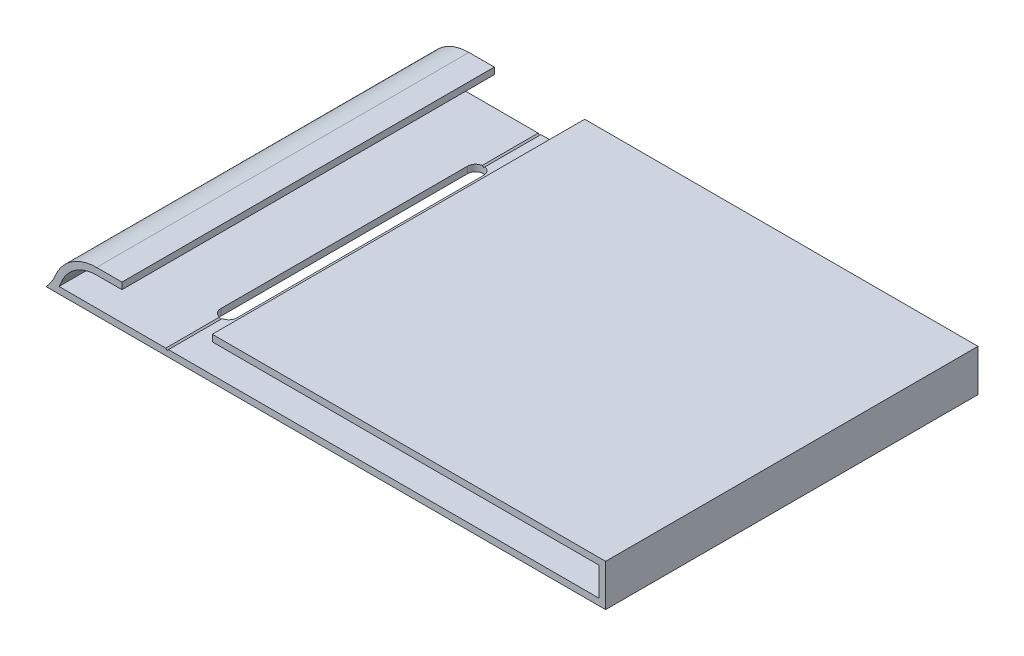
ISO-10303-21;
HEADER;
FILE_DESCRIPTION(('STEP AP214'),'2;1');
FILE_NAME('part.step','',(''),(''),'','','');
FILE_SCHEMA(('AUTOMOTIVE_DESIGN { 1 0 10303 214 1 1 1 1 }'));
ENDSEC;
DATA;
#1=APPLICATION_CONTEXT('core data for automotive mechanical design processes');
#2=APPLICATION_PROTOCOL_DEFINITION('international standard','automotive_design',2000,#1);
#3=PRODUCT_CONTEXT('',#1,'mechanical');
#4=PRODUCT('Part','Part','',(#3));
#5=PRODUCT_RELATED_PRODUCT_CATEGORY('part','',(#4));
#6=PRODUCT_DEFINITION_FORMATION('','',#4);
#7=PRODUCT_DEFINITION_CONTEXT('part definition',#1,'design');
#8=PRODUCT_DEFINITION('design','',#6,#7);
#9=PRODUCT_DEFINITION_SHAPE('','',#8);
#10=(LENGTH_UNIT() NAMED_UNIT(*) SI_UNIT(.MILLI.,.METRE.));
#11=(NAMED_UNIT(*) PLANE_ANGLE_UNIT() SI_UNIT($,.RADIAN.));
#12=(NAMED_UNIT(*) SI_UNIT($,.STERADIAN.) SOLID_ANGLE_UNIT());
#13=UNCERTAINTY_MEASURE_WITH_UNIT(LENGTH_MEASURE(1.E-05),#10,'distance_accuracy_value','');
#14=(GEOMETRIC_REPRESENTATION_CONTEXT(3) GLOBAL_UNCERTAINTY_ASSIGNED_CONTEXT((#13)) GLOBAL_UNIT_ASSIGNED_CONTEXT((#10,
#11,#12)) REPRESENTATION_CONTEXT('',''));
#15=CARTESIAN_POINT('',(0.,0.,0.));
#16=DIRECTION('',(0.,0.,1.));
#17=DIRECTION('',(1.,0.,0.));
#18=AXIS2_PLACEMENT_3D('',#15,#16,#17);
#19=CARTESIAN_POINT('',(-66.6999999999992,102.,100.67082039325));
#20=DIRECTION('',(0.707106781186531,-0.707106781186564,0.));
#21=DIRECTION('',(0.707106781186564,0.707106781186531,0.));
#22=AXIS2_PLACEMENT_3D('',#19,#20,#21);
#23=PLANE('',#22);
#24=DIRECTION('',(0.,0.,-1.));
#25=VECTOR('',#24,1.);
#26=CARTESIAN_POINT('',(-66.6999999999992,102.,100.67082039325));
#27=LINE('',#26,#25);
#28=CARTESIAN_POINT('',(-66.6999999999992,102.,-241.5));
#29=VERTEX_POINT('',#28);
#30=CARTESIAN_POINT('',(-66.6999999999992,102.,-253.699826397253));
#31=VERTEX_POINT('',#30);
#32=EDGE_CURVE('E256',#29,#31,#27,.T.);
#33=ORIENTED_EDGE('',*,*,#32,.T.);
#34=CARTESIAN_POINT('',(-67.0000000000007,101.699999999998,-255.5));
#35=DIRECTION('',(0.707106781186531,-0.707106781186564,0.));
#36=DIRECTION('',(0.707106781186564,0.707106781186531,0.));
#37=AXIS2_PLACEMENT_3D('',#34,#35,#36);
#38=ELLIPSE('',#37,2.58093975134183,1.82500000000778);
#39=CARTESIAN_POINT('',(-66.9999999999992,101.7,-253.674999999992));
#40=VERTEX_POINT('',#39);
#41=EDGE_CURVE('E219',#31,#40,#38,.T.);
#42=ORIENTED_EDGE('',*,*,#41,.T.);
#43=DIRECTION('',(0.,0.,-1.));
#44=VECTOR('',#43,1.);
#45=CARTESIAN_POINT('',(-66.9999999999992,101.7,100.67082039325));
#46=LINE('',#45,#44);
#47=CARTESIAN_POINT('',(-66.9999999999992,101.7,-241.5));
#48=VERTEX_POINT('',#47);
#49=EDGE_CURVE('E253',#48,#40,#46,.T.);
#50=ORIENTED_EDGE('',*,*,#49,.F.);
#51=DIRECTION('',(-0.707106781186564,-0.707106781186531,0.));
#52=VECTOR('',#51,1.);
#53=CARTESIAN_POINT('',(-84.3499999999979,84.3500000000017,-241.5));
#54=LINE('',#53,#52);
#55=EDGE_CURVE('E262',#29,#48,#54,.T.);
#56=ORIENTED_EDGE('',*,*,#55,.F.);
#57=EDGE_LOOP('',(#33,#42,#50,#56));
#58=FACE_BOUND('',#57,.T.);
#59=ADVANCED_FACE('F35',(#58),#23,.F.);
#60=CARTESIAN_POINT('',(-66.9999999999992,101.7,100.67082039325));
#61=DIRECTION('',(-0.707106781186531,-0.707106781186564,0.));
#62=DIRECTION('',(0.707106781186564,-0.707106781186531,0.));
#63=AXIS2_PLACEMENT_3D('',#60,#61,#62);
#64=PLANE('',#63);
#65=ORIENTED_EDGE('',*,*,#49,.T.);
#66=CARTESIAN_POINT('',(-67.0000000000007,101.700000000001,-255.5));
#67=DIRECTION('',(-0.707106781186531,-0.707106781186564,0.));
#68=DIRECTION('',(-0.707106781186564,0.707106781186531,0.));
#69=AXIS2_PLACEMENT_3D('',#66,#67,#68);
#70=ELLIPSE('',#69,2.58093975134185,1.82500000000778);
#71=CARTESIAN_POINT('',(-67.2999999999992,102.,-253.699826397252));
#72=VERTEX_POINT('',#71);
#73=EDGE_CURVE('E365',#40,#72,#70,.T.);
#74=ORIENTED_EDGE('',*,*,#73,.T.);
#75=DIRECTION('',(0.,0.,-1.));
#76=VECTOR('',#75,1.);
#77=CARTESIAN_POINT('',(-67.2999999999992,102.,100.67082039325));
#78=LINE('',#77,#76);
#79=CARTESIAN_POINT('',(-67.2999999999992,102.,-241.5));
#80=VERTEX_POINT('',#79);
#81=EDGE_CURVE('E249',#80,#72,#78,.T.);
#82=ORIENTED_EDGE('',*,*,#81,.F.);
#83=DIRECTION('',(-0.707106781186564,0.707106781186531,0.));
#84=VECTOR('',#83,1.);
#85=CARTESIAN_POINT('',(17.3500000000018,17.3500000000026,-241.5));
#86=LINE('',#85,#84);
#87=EDGE_CURVE('E259',#48,#80,#86,.T.);
#88=ORIENTED_EDGE('',*,*,#87,.F.);
#89=EDGE_LOOP('',(#65,#74,#82,#88));
#90=FACE_BOUND('',#89,.T.);
#91=ADVANCED_FACE('F391',(#90),#64,.F.);
#92=CARTESIAN_POINT('',(0.,110.,-421.5));
#93=DIRECTION('',(0.,-1.,0.));
#94=DIRECTION('',(0.,0.,-1.));
#95=AXIS2_PLACEMENT_3D('',#92,#93,#94);
#96=PLANE('',#95);
#97=DIRECTION('',(1.,0.,0.));
#98=VECTOR('',#97,1.);
#99=CARTESIAN_POINT('',(0.,110.,-241.5));
#100=LINE('',#99,#98);
#101=CARTESIAN_POINT('',(-83.,110.,-241.5));
#102=VERTEX_POINT('',#101);
#103=CARTESIAN_POINT('',(-77.25,110.,-241.5));
#104=VERTEX_POINT('',#103);
#105=EDGE_CURVE('E316',#102,#104,#100,.T.);
#106=ORIENTED_EDGE('',*,*,#105,.T.);
#107=DIRECTION('',(0.,0.,-1.));
#108=VECTOR('',#107,1.);
#109=CARTESIAN_POINT('',(-77.25,110.,-169.5));
#110=LINE('',#109,#108);
#111=CARTESIAN_POINT('',(-77.25,110.,-326.));
#112=VERTEX_POINT('',#111);
#113=EDGE_CURVE('E233',#104,#112,#110,.T.);
#114=ORIENTED_EDGE('',*,*,#113,.T.);
#115=DIRECTION('',(1.,0.,0.));
#116=VECTOR('',#115,1.);
#117=CARTESIAN_POINT('',(-120.,110.,-326.));
#118=LINE('',#117,#116);
#119=CARTESIAN_POINT('',(-83.,110.,-326.));
#120=VERTEX_POINT('',#119);
#121=EDGE_CURVE('E266',#120,#112,#118,.T.);
#122=ORIENTED_EDGE('',*,*,#121,.F.);
#123=DIRECTION('',(0.,0.,1.));
#124=VECTOR('',#123,1.);
#125=CARTESIAN_POINT('',(-83.,110.,-421.5));
#126=LINE('',#125,#124);
#127=EDGE_CURVE('E334',#120,#102,#126,.T.);
#128=ORIENTED_EDGE('',*,*,#127,.T.);
#129=EDGE_LOOP('',(#106,#114,#122,#128));
#130=FACE_BOUND('',#129,.T.);
#131=ADVANCED_FACE('F437',(#130),#96,.F.);
#132=CARTESIAN_POINT('',(0.,108.5,-421.5));
#133=DIRECTION('',(0.,-1.,0.));
#134=DIRECTION('',(0.,0.,-1.));
#135=AXIS2_PLACEMENT_3D('',#132,#133,#134);
#136=PLANE('',#135);
#137=DIRECTION('',(0.,0.,1.));
#138=VECTOR('',#137,1.);
#139=CARTESIAN_POINT('',(-56.75,108.5,-421.5));
#140=LINE('',#139,#138);
#141=CARTESIAN_POINT('',(-56.75,108.5,-326.));
#142=VERTEX_POINT('',#141);
#143=CARTESIAN_POINT('',(-56.75,108.5,-241.5));
#144=VERTEX_POINT('',#143);
#145=EDGE_CURVE('E236',#142,#144,#140,.T.);
#146=ORIENTED_EDGE('',*,*,#145,.F.);
#147=DIRECTION('',(-1.,0.,0.));
#148=VECTOR('',#147,1.);
#149=CARTESIAN_POINT('',(0.,108.5,-326.));
#150=LINE('',#149,#148);
#151=CARTESIAN_POINT('',(31.,108.5,-326.));
#152=VERTEX_POINT('',#151);
#153=EDGE_CURVE('E278',#152,#142,#150,.T.);
#154=ORIENTED_EDGE('',*,*,#153,.F.);
#155=DIRECTION('',(0.,0.,1.));
#156=VECTOR('',#155,1.);
#157=CARTESIAN_POINT('',(31.,108.5,-421.5));
#158=LINE('',#157,#156);
#159=CARTESIAN_POINT('',(31.,108.5,-241.5));
#160=VERTEX_POINT('',#159);
#161=EDGE_CURVE('E340',#152,#160,#158,.T.);
#162=ORIENTED_EDGE('',*,*,#161,.T.);
#163=DIRECTION('',(1.,0.,0.));
#164=VECTOR('',#163,1.);
#165=CARTESIAN_POINT('',(0.,108.5,-241.5));
#166=LINE('',#165,#164);
#167=EDGE_CURVE('E305',#144,#160,#166,.T.);
#168=ORIENTED_EDGE('',*,*,#167,.F.);
#169=EDGE_LOOP('',(#146,#154,#162,#168));
#170=FACE_BOUND('',#169,.T.);
#171=ADVANCED_FACE('F409',(#170),#136,.T.);
#172=CARTESIAN_POINT('',(0.,102.,-421.5));
#173=DIRECTION('',(0.,1.,0.));
#174=DIRECTION('',(0.,0.,1.));
#175=AXIS2_PLACEMENT_3D('',#172,#173,#174);
#176=PLANE('',#175);
#177=CARTESIAN_POINT('',(-67.0000000000007,102.,-255.5));
#178=DIRECTION('',(0.,1.,0.));
#179=DIRECTION('',(0.,0.,1.));
#180=AXIS2_PLACEMENT_3D('',#177,#178,#179);
#181=CIRCLE('',#180,1.82500000000778);
#182=CARTESIAN_POINT('',(-65.1749999999922,102.,-255.5));
#183=VERTEX_POINT('',#182);
#184=EDGE_CURVE('E228',#31,#183,#181,.T.);
#185=ORIENTED_EDGE('',*,*,#184,.F.);
#186=ORIENTED_EDGE('',*,*,#32,.F.);
#187=DIRECTION('',(-1.,0.,0.));
#188=VECTOR('',#187,1.);
#189=CARTESIAN_POINT('',(0.,102.,-241.5));
#190=LINE('',#189,#188);
#191=CARTESIAN_POINT('',(31.,102.,-241.5));
#192=VERTEX_POINT('',#191);
#193=EDGE_CURVE('E299',#192,#29,#190,.T.);
#194=ORIENTED_EDGE('',*,*,#193,.F.);
#195=DIRECTION('',(0.,0.,1.));
#196=VECTOR('',#195,1.);
#197=CARTESIAN_POINT('',(31.,102.,-421.5));
#198=LINE('',#197,#196);
#199=CARTESIAN_POINT('',(31.,102.,-326.));
#200=VERTEX_POINT('',#199);
#201=EDGE_CURVE('E343',#200,#192,#198,.T.);
#202=ORIENTED_EDGE('',*,*,#201,.F.);
#203=DIRECTION('',(1.,0.,0.));
#204=VECTOR('',#203,1.);
#205=CARTESIAN_POINT('',(0.,102.,-326.));
#206=LINE('',#205,#204);
#207=CARTESIAN_POINT('',(-66.6999999999992,102.,-326.));
#208=VERTEX_POINT('',#207);
#209=EDGE_CURVE('E283',#208,#200,#206,.T.);
#210=ORIENTED_EDGE('',*,*,#209,.F.);
#211=CARTESIAN_POINT('',(-66.6999999999992,102.,-313.300173602747));
#212=VERTEX_POINT('',#211);
#213=EDGE_CURVE('E216',#212,#208,#27,.T.);
#214=ORIENTED_EDGE('',*,*,#213,.F.);
#215=CARTESIAN_POINT('',(-67.0000000000007,102.,-311.5));
#216=DIRECTION('',(0.,1.,0.));
#217=DIRECTION('',(0.,0.,1.));
#218=AXIS2_PLACEMENT_3D('',#215,#216,#217);
#219=CIRCLE('',#218,1.82500000000778);
#220=CARTESIAN_POINT('',(-65.1749999999922,102.,-311.5));
#221=VERTEX_POINT('',#220);
#222=EDGE_CURVE('E206',#221,#212,#219,.T.);
#223=ORIENTED_EDGE('',*,*,#222,.F.);
#224=DIRECTION('',(0.,0.,-1.));
#225=VECTOR('',#224,1.);
#226=CARTESIAN_POINT('',(-65.1749999999922,102.,-421.5));
#227=LINE('',#226,#225);
#228=EDGE_CURVE('E195',#183,#221,#227,.T.);
#229=ORIENTED_EDGE('',*,*,#228,.F.);
#230=EDGE_LOOP('',(#185,#186,#194,#202,#210,#214,#223,#229));
#231=FACE_BOUND('',#230,.T.);
#232=ADVANCED_FACE('F214',(#231),#176,.T.);
#233=CARTESIAN_POINT('',(-101.758107565017,107.555793957317,-421.5));
#234=DIRECTION('',(0.,0.,1.));
#235=DIRECTION('',(1.,0.,0.));
#236=AXIS2_PLACEMENT_3D('',#233,#234,#235);
#237=CYLINDRICAL_SURFACE('',#236,10.1371613475259);
#238=CARTESIAN_POINT('',(-101.758107565017,107.555793957317,-326.));
#239=DIRECTION('',(0.,0.,1.));
#240=DIRECTION('',(1.,0.,0.));
#241=AXIS2_PLACEMENT_3D('',#238,#239,#240);
#242=CIRCLE('',#241,10.1371613475259);
#243=CARTESIAN_POINT('',(-94.4795217258819,100.5,-326.));
#244=VERTEX_POINT('',#243);
#245=CARTESIAN_POINT('',(-92.3790537825084,103.709316304896,-326.));
#246=VERTEX_POINT('',#245);
#247=EDGE_CURVE('E272',#244,#246,#242,.T.);
#248=ORIENTED_EDGE('',*,*,#247,.F.);
#249=DIRECTION('',(0.,0.,1.));
#250=VECTOR('',#249,1.);
#251=CARTESIAN_POINT('',(-94.4795217258819,100.5,-421.5));
#252=LINE('',#251,#250);
#253=CARTESIAN_POINT('',(-94.4795217258819,100.5,-241.5));
#254=VERTEX_POINT('',#253);
#255=EDGE_CURVE('E326',#244,#254,#252,.T.);
#256=ORIENTED_EDGE('',*,*,#255,.T.);
#257=CARTESIAN_POINT('',(-101.758107565017,107.555793957317,-241.5));
#258=DIRECTION('',(0.,0.,-1.));
#259=DIRECTION('',(-1.,0.,0.));
#260=AXIS2_PLACEMENT_3D('',#257,#258,#259);
#261=CIRCLE('',#260,10.1371613475259);
#262=CARTESIAN_POINT('',(-92.3790537825084,103.709316304896,-241.5));
#263=VERTEX_POINT('',#262);
#264=EDGE_CURVE('E309',#263,#254,#261,.T.);
#265=ORIENTED_EDGE('',*,*,#264,.F.);
#266=DIRECTION('',(0.,0.,1.));
#267=VECTOR('',#266,1.);
#268=CARTESIAN_POINT('',(-92.3790537825084,103.709316304896,-421.5));
#269=LINE('',#268,#267);
#270=EDGE_CURVE('E336',#246,#263,#269,.T.);
#271=ORIENTED_EDGE('',*,*,#270,.F.);
#272=EDGE_LOOP('',(#248,#256,#265,#271));
#273=FACE_BOUND('',#272,.T.);
#274=ADVANCED_FACE('F428',(#273),#237,.F.);
#275=CARTESIAN_POINT('',(-83.,99.8628386524749,-421.5));
#276=DIRECTION('',(0.,0.,1.));
#277=DIRECTION('',(1.,0.,0.));
#278=AXIS2_PLACEMENT_3D('',#275,#276,#277);
#279=CYLINDRICAL_SURFACE('',#278,10.1371613475251);
#280=ORIENTED_EDGE('',*,*,#127,.F.);
#281=CARTESIAN_POINT('',(-83.,99.8628386524749,-326.));
#282=DIRECTION('',(0.,0.,1.));
#283=DIRECTION('',(1.,0.,0.));
#284=AXIS2_PLACEMENT_3D('',#281,#282,#283);
#285=CIRCLE('',#284,10.1371613475251);
#286=EDGE_CURVE('E274',#120,#246,#285,.T.);
#287=ORIENTED_EDGE('',*,*,#286,.T.);
#288=ORIENTED_EDGE('',*,*,#270,.T.);
#289=CARTESIAN_POINT('',(-83.,99.8628386524749,-241.5));
#290=DIRECTION('',(0.,0.,-1.));
#291=DIRECTION('',(-1.,0.,0.));
#292=AXIS2_PLACEMENT_3D('',#289,#290,#291);
#293=CIRCLE('',#292,10.1371613475251);
#294=EDGE_CURVE('E312',#263,#102,#293,.T.);
#295=ORIENTED_EDGE('',*,*,#294,.T.);
#296=EDGE_LOOP('',(#280,#287,#288,#295));
#297=FACE_BOUND('',#296,.T.);
#298=ADVANCED_FACE('F433',(#297),#279,.T.);
#299=CARTESIAN_POINT('',(-56.75,110.,-326.));
#300=VERTEX_POINT('',#299);
#301=CARTESIAN_POINT('',(32.5,110.,-326.));
#302=VERTEX_POINT('',#301);
#303=EDGE_CURVE('E265',#300,#302,#118,.T.);
#304=ORIENTED_EDGE('',*,*,#303,.F.);
#305=DIRECTION('',(0.,0.,-1.));
#306=VECTOR('',#305,1.);
#307=CARTESIAN_POINT('',(-56.75,110.,-169.5));
#308=LINE('',#307,#306);
#309=CARTESIAN_POINT('',(-56.75,110.,-241.5));
#310=VERTEX_POINT('',#309);
#311=EDGE_CURVE('E234',#310,#300,#308,.T.);
#312=ORIENTED_EDGE('',*,*,#311,.F.);
#313=CARTESIAN_POINT('',(32.5,110.,-241.5));
#314=VERTEX_POINT('',#313);
#315=EDGE_CURVE('E315',#310,#314,#100,.T.);
#316=ORIENTED_EDGE('',*,*,#315,.T.);
#317=DIRECTION('',(0.,0.,1.));
#318=VECTOR('',#317,1.);
#319=CARTESIAN_POINT('',(32.5,110.,-421.5));
#320=LINE('',#319,#318);
#321=EDGE_CURVE('E331',#302,#314,#320,.T.);
#322=ORIENTED_EDGE('',*,*,#321,.F.);
#323=EDGE_LOOP('',(#304,#312,#316,#322));
#324=FACE_BOUND('',#323,.T.);
#325=ADVANCED_FACE('F420',(#324),#96,.F.);
#326=CARTESIAN_POINT('',(32.5,0.,-421.5));
#327=DIRECTION('',(-1.,0.,0.));
#328=DIRECTION('',(0.,0.,1.));
#329=AXIS2_PLACEMENT_3D('',#326,#327,#328);
#330=PLANE('',#329);
#331=DIRECTION('',(0.,0.,1.));
#332=VECTOR('',#331,1.);
#333=CARTESIAN_POINT('',(32.5,100.5,-421.5));
#334=LINE('',#333,#332);
#335=CARTESIAN_POINT('',(32.5,100.5,-326.));
#336=VERTEX_POINT('',#335);
#337=CARTESIAN_POINT('',(32.5,100.5,-241.5));
#338=VERTEX_POINT('',#337);
#339=EDGE_CURVE('E328',#336,#338,#334,.T.);
#340=ORIENTED_EDGE('',*,*,#339,.F.);
#341=DIRECTION('',(0.,1.,0.));
#342=VECTOR('',#341,1.);
#343=CARTESIAN_POINT('',(32.5,0.,-326.));
#344=LINE('',#343,#342);
#345=EDGE_CURVE('E269',#336,#302,#344,.T.);
#346=ORIENTED_EDGE('',*,*,#345,.T.);
#347=ORIENTED_EDGE('',*,*,#321,.T.);
#348=DIRECTION('',(0.,-1.,0.));
#349=VECTOR('',#348,1.);
#350=CARTESIAN_POINT('',(32.5,0.,-241.5));
#351=LINE('',#350,#349);
#352=EDGE_CURVE('E319',#314,#338,#351,.T.);
#353=ORIENTED_EDGE('',*,*,#352,.T.);
#354=EDGE_LOOP('',(#340,#346,#347,#353));
#355=FACE_BOUND('',#354,.T.);
#356=ADVANCED_FACE('F423',(#355),#330,.F.);
#357=CARTESIAN_POINT('',(-83.,99.8628386524749,-421.5));
#358=DIRECTION('',(0.,0.,1.));
#359=DIRECTION('',(1.,0.,0.));
#360=AXIS2_PLACEMENT_3D('',#357,#358,#359);
#361=CYLINDRICAL_SURFACE('',#360,8.63716134752511);
#362=CARTESIAN_POINT('',(-83.,99.8628386524749,-326.));
#363=DIRECTION('',(0.,0.,1.));
#364=DIRECTION('',(1.,0.,0.));
#365=AXIS2_PLACEMENT_3D('',#362,#363,#364);
#366=CIRCLE('',#365,8.63716134752511);
#367=CARTESIAN_POINT('',(-83.,108.5,-326.));
#368=VERTEX_POINT('',#367);
#369=CARTESIAN_POINT('',(-90.9912312756488,103.14015139957,-326.));
#370=VERTEX_POINT('',#369);
#371=EDGE_CURVE('E290',#368,#370,#366,.T.);
#372=ORIENTED_EDGE('',*,*,#371,.F.);
#373=DIRECTION('',(0.,0.,1.));
#374=VECTOR('',#373,1.);
#375=CARTESIAN_POINT('',(-83.,108.5,-421.5));
#376=LINE('',#375,#374);
#377=CARTESIAN_POINT('',(-83.,108.5,-241.5));
#378=VERTEX_POINT('',#377);
#379=EDGE_CURVE('E325',#368,#378,#376,.T.);
#380=ORIENTED_EDGE('',*,*,#379,.T.);
#381=CARTESIAN_POINT('',(-83.,99.8628386524749,-241.5));
#382=DIRECTION('',(0.,0.,-1.));
#383=DIRECTION('',(-1.,0.,0.));
#384=AXIS2_PLACEMENT_3D('',#381,#382,#383);
#385=CIRCLE('',#384,8.63716134752511);
#386=CARTESIAN_POINT('',(-90.9912312756488,103.14015139957,-241.5));
#387=VERTEX_POINT('',#386);
#388=EDGE_CURVE('E292',#387,#378,#385,.T.);
#389=ORIENTED_EDGE('',*,*,#388,.F.);
#390=DIRECTION('',(0.,0.,1.));
#391=VECTOR('',#390,1.);
#392=CARTESIAN_POINT('',(-90.9912312756488,103.14015139957,-421.5));
#393=LINE('',#392,#391);
#394=EDGE_CURVE('E329',#370,#387,#393,.T.);
#395=ORIENTED_EDGE('',*,*,#394,.F.);
#396=EDGE_LOOP('',(#372,#380,#389,#395));
#397=FACE_BOUND('',#396,.T.);
#398=ADVANCED_FACE('F37',(#397),#361,.F.);
#399=CARTESIAN_POINT('',(-101.758107565017,107.555793957317,-421.5));
#400=DIRECTION('',(0.,0.,1.));
#401=DIRECTION('',(1.,0.,0.));
#402=AXIS2_PLACEMENT_3D('',#399,#400,#401);
#403=CYLINDRICAL_SURFACE('',#402,11.6371613475259);
#404=DIRECTION('',(0.,0.,1.));
#405=VECTOR('',#404,1.);
#406=CARTESIAN_POINT('',(-91.5328115921767,102.,-421.5));
#407=LINE('',#406,#405);
#408=CARTESIAN_POINT('',(-91.5328115921767,102.,-326.));
#409=VERTEX_POINT('',#408);
#410=CARTESIAN_POINT('',(-91.5328115921767,102.,-241.5));
#411=VERTEX_POINT('',#410);
#412=EDGE_CURVE('E345',#409,#411,#407,.T.);
#413=ORIENTED_EDGE('',*,*,#412,.F.);
#414=CARTESIAN_POINT('',(-101.758107565017,107.555793957317,-326.));
#415=DIRECTION('',(0.,0.,1.));
#416=DIRECTION('',(1.,0.,0.));
#417=AXIS2_PLACEMENT_3D('',#414,#415,#416);
#418=CIRCLE('',#417,11.6371613475259);
#419=EDGE_CURVE('E287',#409,#370,#418,.T.);
#420=ORIENTED_EDGE('',*,*,#419,.T.);
#421=ORIENTED_EDGE('',*,*,#394,.T.);
#422=CARTESIAN_POINT('',(-101.758107565017,107.555793957317,-241.5));
#423=DIRECTION('',(0.,0.,-1.));
#424=DIRECTION('',(-1.,0.,0.));
#425=AXIS2_PLACEMENT_3D('',#422,#423,#424);
#426=CIRCLE('',#425,11.6371613475259);
#427=EDGE_CURVE('E295',#387,#411,#426,.T.);
#428=ORIENTED_EDGE('',*,*,#427,.T.);
#429=EDGE_LOOP('',(#413,#420,#421,#428));
#430=FACE_BOUND('',#429,.T.);
#431=ADVANCED_FACE('F453',(#430),#403,.T.);
#432=CARTESIAN_POINT('',(-67.0000000000007,102.,-255.5));
#433=DIRECTION('',(0.,1.,0.));
#434=DIRECTION('',(0.,0.,1.));
#435=AXIS2_PLACEMENT_3D('',#432,#433,#434);
#436=CIRCLE('',#435,1.82500000000778);
#437=CARTESIAN_POINT('',(-68.8250000000078,102.,-255.5));
#438=VERTEX_POINT('',#437);
#439=EDGE_CURVE('E226',#438,#72,#436,.T.);
#440=ORIENTED_EDGE('',*,*,#439,.F.);
#441=DIRECTION('',(0.,0.,1.));
#442=VECTOR('',#441,1.);
#443=CARTESIAN_POINT('',(-68.8250000000078,102.,-421.5));
#444=LINE('',#443,#442);
#445=CARTESIAN_POINT('',(-68.8250000000084,102.,-311.5));
#446=VERTEX_POINT('',#445);
#447=EDGE_CURVE('E202',#446,#438,#444,.T.);
#448=ORIENTED_EDGE('',*,*,#447,.F.);
#449=CARTESIAN_POINT('',(-67.0000000000007,102.,-311.5));
#450=DIRECTION('',(0.,1.,0.));
#451=DIRECTION('',(0.,0.,1.));
#452=AXIS2_PLACEMENT_3D('',#449,#450,#451);
#453=CIRCLE('',#452,1.82500000000778);
#454=CARTESIAN_POINT('',(-67.2999999999992,102.,-313.300173602747));
#455=VERTEX_POINT('',#454);
#456=EDGE_CURVE('E217',#455,#446,#453,.T.);
#457=ORIENTED_EDGE('',*,*,#456,.F.);
#458=CARTESIAN_POINT('',(-67.2999999999992,102.,-326.));
#459=VERTEX_POINT('',#458);
#460=EDGE_CURVE('E252',#455,#459,#78,.T.);
#461=ORIENTED_EDGE('',*,*,#460,.T.);
#462=EDGE_CURVE('E284',#409,#459,#206,.T.);
#463=ORIENTED_EDGE('',*,*,#462,.F.);
#464=ORIENTED_EDGE('',*,*,#412,.T.);
#465=EDGE_CURVE('E298',#80,#411,#190,.T.);
#466=ORIENTED_EDGE('',*,*,#465,.F.);
#467=ORIENTED_EDGE('',*,*,#81,.T.);
#468=EDGE_LOOP('',(#440,#448,#457,#461,#463,#464,#466,#467));
#469=FACE_BOUND('',#468,.T.);
#470=ADVANCED_FACE('F387',(#469),#176,.T.);
#471=CARTESIAN_POINT('',(31.,0.,-421.5));
#472=DIRECTION('',(-1.,0.,0.));
#473=DIRECTION('',(0.,0.,1.));
#474=AXIS2_PLACEMENT_3D('',#471,#472,#473);
#475=PLANE('',#474);
#476=DIRECTION('',(0.,1.,0.));
#477=VECTOR('',#476,1.);
#478=CARTESIAN_POINT('',(31.,0.,-326.));
#479=LINE('',#478,#477);
#480=EDGE_CURVE('E281',#200,#152,#479,.T.);
#481=ORIENTED_EDGE('',*,*,#480,.F.);
#482=ORIENTED_EDGE('',*,*,#201,.T.);
#483=DIRECTION('',(0.,-1.,0.));
#484=VECTOR('',#483,1.);
#485=CARTESIAN_POINT('',(31.,0.,-241.5));
#486=LINE('',#485,#484);
#487=EDGE_CURVE('E302',#160,#192,#486,.T.);
#488=ORIENTED_EDGE('',*,*,#487,.F.);
#489=ORIENTED_EDGE('',*,*,#161,.F.);
#490=EDGE_LOOP('',(#481,#482,#488,#489));
#491=FACE_BOUND('',#490,.T.);
#492=ADVANCED_FACE('F402',(#491),#475,.T.);
#493=DIRECTION('',(0.,0.,-1.));
#494=VECTOR('',#493,1.);
#495=CARTESIAN_POINT('',(-77.25,108.5,-421.5));
#496=LINE('',#495,#494);
#497=CARTESIAN_POINT('',(-77.25,108.5,-241.5));
#498=VERTEX_POINT('',#497);
#499=CARTESIAN_POINT('',(-77.25,108.5,-326.));
#500=VERTEX_POINT('',#499);
#501=EDGE_CURVE('E243',#498,#500,#496,.T.);
#502=ORIENTED_EDGE('',*,*,#501,.F.);
#503=EDGE_CURVE('E306',#378,#498,#166,.T.);
#504=ORIENTED_EDGE('',*,*,#503,.F.);
#505=ORIENTED_EDGE('',*,*,#379,.F.);
#506=EDGE_CURVE('E277',#500,#368,#150,.T.);
#507=ORIENTED_EDGE('',*,*,#506,.F.);
#508=EDGE_LOOP('',(#502,#504,#505,#507));
#509=FACE_BOUND('',#508,.T.);
#510=ADVANCED_FACE('F444',(#509),#136,.T.);
#511=CARTESIAN_POINT('',(0.,100.5,-421.5));
#512=DIRECTION('',(0.,1.,0.));
#513=DIRECTION('',(-1.,0.,0.));
#514=AXIS2_PLACEMENT_3D('',#511,#512,#513);
#515=PLANE('',#514);
#516=DIRECTION('',(0.,0.,1.));
#517=VECTOR('',#516,1.);
#518=CARTESIAN_POINT('',(-68.8250000000078,100.5,-421.5));
#519=LINE('',#518,#517);
#520=CARTESIAN_POINT('',(-68.8250000000084,100.5,-311.5));
#521=VERTEX_POINT('',#520);
#522=CARTESIAN_POINT('',(-68.8250000000078,100.5,-255.5));
#523=VERTEX_POINT('',#522);
#524=EDGE_CURVE('E11',#521,#523,#519,.T.);
#525=ORIENTED_EDGE('',*,*,#524,.T.);
#526=CARTESIAN_POINT('',(-67.0000000000006,100.5,-255.5));
#527=DIRECTION('',(0.,1.,0.));
#528=DIRECTION('',(-1.,0.,0.));
#529=AXIS2_PLACEMENT_3D('',#526,#527,#528);
#530=CIRCLE('',#529,1.82500000000778);
#531=CARTESIAN_POINT('',(-65.1749999999922,100.5,-255.5));
#532=VERTEX_POINT('',#531);
#533=EDGE_CURVE('E203',#523,#532,#530,.T.);
#534=ORIENTED_EDGE('',*,*,#533,.T.);
#535=DIRECTION('',(0.,0.,-1.));
#536=VECTOR('',#535,1.);
#537=CARTESIAN_POINT('',(-65.1749999999922,100.5,-421.5));
#538=LINE('',#537,#536);
#539=CARTESIAN_POINT('',(-65.1749999999922,100.5,-311.5));
#540=VERTEX_POINT('',#539);
#541=EDGE_CURVE('E43',#532,#540,#538,.T.);
#542=ORIENTED_EDGE('',*,*,#541,.T.);
#543=CARTESIAN_POINT('',(-67.0000000000007,100.5,-311.5));
#544=DIRECTION('',(0.,1.,0.));
#545=DIRECTION('',(-1.,0.,0.));
#546=AXIS2_PLACEMENT_3D('',#543,#544,#545);
#547=CIRCLE('',#546,1.82500000000778);
#548=EDGE_CURVE('E209',#540,#521,#547,.T.);
#549=ORIENTED_EDGE('',*,*,#548,.T.);
#550=EDGE_LOOP('',(#525,#534,#542,#549));
#551=FACE_BOUND('',#550,.T.);
#552=ORIENTED_EDGE('',*,*,#255,.F.);
#553=DIRECTION('',(1.,0.,0.));
#554=VECTOR('',#553,1.);
#555=CARTESIAN_POINT('',(0.,100.5,-326.));
#556=LINE('',#555,#554);
#557=EDGE_CURVE('E338',#244,#336,#556,.T.);
#558=ORIENTED_EDGE('',*,*,#557,.T.);
#559=ORIENTED_EDGE('',*,*,#339,.T.);
#560=DIRECTION('',(-1.,0.,0.));
#561=VECTOR('',#560,1.);
#562=CARTESIAN_POINT('',(0.,100.5,-241.5));
#563=LINE('',#562,#561);
#564=EDGE_CURVE('E322',#338,#254,#563,.T.);
#565=ORIENTED_EDGE('',*,*,#564,.T.);
#566=EDGE_LOOP('',(#552,#558,#559,#565));
#567=FACE_BOUND('',#566,.T.);
#568=ADVANCED_FACE('F368',(#551,#567),#515,.F.);
#569=CARTESIAN_POINT('',(0.,0.,-241.5));
#570=DIRECTION('',(0.,0.,-1.));
#571=DIRECTION('',(-1.,0.,0.));
#572=AXIS2_PLACEMENT_3D('',#569,#570,#571);
#573=PLANE('',#572);
#574=ORIENTED_EDGE('',*,*,#503,.T.);
#575=DIRECTION('',(0.,1.,0.));
#576=VECTOR('',#575,1.);
#577=CARTESIAN_POINT('',(-77.25,0.,-241.5));
#578=LINE('',#577,#576);
#579=EDGE_CURVE('E245',#498,#104,#578,.T.);
#580=ORIENTED_EDGE('',*,*,#579,.T.);
#581=ORIENTED_EDGE('',*,*,#105,.F.);
#582=ORIENTED_EDGE('',*,*,#294,.F.);
#583=ORIENTED_EDGE('',*,*,#264,.T.);
#584=ORIENTED_EDGE('',*,*,#564,.F.);
#585=ORIENTED_EDGE('',*,*,#352,.F.);
#586=ORIENTED_EDGE('',*,*,#315,.F.);
#587=DIRECTION('',(0.,-1.,0.));
#588=VECTOR('',#587,1.);
#589=CARTESIAN_POINT('',(-56.75,0.,-241.5));
#590=LINE('',#589,#588);
#591=EDGE_CURVE('E240',#310,#144,#590,.T.);
#592=ORIENTED_EDGE('',*,*,#591,.T.);
#593=ORIENTED_EDGE('',*,*,#167,.T.);
#594=ORIENTED_EDGE('',*,*,#487,.T.);
#595=ORIENTED_EDGE('',*,*,#193,.T.);
#596=ORIENTED_EDGE('',*,*,#55,.T.);
#597=ORIENTED_EDGE('',*,*,#87,.T.);
#598=ORIENTED_EDGE('',*,*,#465,.T.);
#599=ORIENTED_EDGE('',*,*,#427,.F.);
#600=ORIENTED_EDGE('',*,*,#388,.T.);
#601=EDGE_LOOP('',(#574,#580,#581,#582,#583,#584,#585,#586,#592,#593,#594,#595,#596,#597,#598,
#599,#600));
#602=FACE_BOUND('',#601,.T.);
#603=ADVANCED_FACE('F396',(#602),#573,.F.);
#604=CARTESIAN_POINT('',(-120.,-110.,-326.));
#605=DIRECTION('',(0.,0.,1.));
#606=DIRECTION('',(1.,0.,0.));
#607=AXIS2_PLACEMENT_3D('',#604,#605,#606);
#608=PLANE('',#607);
#609=ORIENTED_EDGE('',*,*,#121,.T.);
#610=DIRECTION('',(0.,-1.,0.));
#611=VECTOR('',#610,1.);
#612=CARTESIAN_POINT('',(-77.25,-110.,-326.));
#613=LINE('',#612,#611);
#614=EDGE_CURVE('E360',#112,#500,#613,.T.);
#615=ORIENTED_EDGE('',*,*,#614,.T.);
#616=ORIENTED_EDGE('',*,*,#506,.T.);
#617=ORIENTED_EDGE('',*,*,#371,.T.);
#618=ORIENTED_EDGE('',*,*,#419,.F.);
#619=ORIENTED_EDGE('',*,*,#462,.T.);
#620=DIRECTION('',(0.707106781186564,-0.707106781186531,0.));
#621=VECTOR('',#620,1.);
#622=CARTESIAN_POINT('',(12.3499999999991,22.3500000000051,-326.));
#623=LINE('',#622,#621);
#624=CARTESIAN_POINT('',(-66.9999999999992,101.7,-326.));
#625=VERTEX_POINT('',#624);
#626=EDGE_CURVE('E351',#459,#625,#623,.T.);
#627=ORIENTED_EDGE('',*,*,#626,.T.);
#628=DIRECTION('',(0.707106781186564,0.707106781186531,0.));
#629=VECTOR('',#628,1.);
#630=CARTESIAN_POINT('',(-199.350000000001,-30.6499999999958,-326.));
#631=LINE('',#630,#629);
#632=EDGE_CURVE('E354',#625,#208,#631,.T.);
#633=ORIENTED_EDGE('',*,*,#632,.T.);
#634=ORIENTED_EDGE('',*,*,#209,.T.);
#635=ORIENTED_EDGE('',*,*,#480,.T.);
#636=ORIENTED_EDGE('',*,*,#153,.T.);
#637=DIRECTION('',(0.,1.,0.));
#638=VECTOR('',#637,1.);
#639=CARTESIAN_POINT('',(-56.75,-110.,-326.));
#640=LINE('',#639,#638);
#641=EDGE_CURVE('E357',#142,#300,#640,.T.);
#642=ORIENTED_EDGE('',*,*,#641,.T.);
#643=ORIENTED_EDGE('',*,*,#303,.T.);
#644=ORIENTED_EDGE('',*,*,#345,.F.);
#645=ORIENTED_EDGE('',*,*,#557,.F.);
#646=ORIENTED_EDGE('',*,*,#247,.T.);
#647=ORIENTED_EDGE('',*,*,#286,.F.);
#648=EDGE_LOOP('',(#609,#615,#616,#617,#618,#619,#627,#633,#634,#635,#636,#642,#643,#644,#645,
#646,#647));
#649=FACE_BOUND('',#648,.T.);
#650=ADVANCED_FACE('F406',(#649),#608,.F.);
#651=CARTESIAN_POINT('',(-66.9999999999992,101.7,-313.325000000008));
#652=VERTEX_POINT('',#651);
#653=EDGE_CURVE('E248',#652,#625,#46,.T.);
#654=ORIENTED_EDGE('',*,*,#653,.F.);
#655=CARTESIAN_POINT('',(-67.0000000000007,101.699999999998,-311.5));
#656=DIRECTION('',(0.707106781186531,-0.707106781186564,0.));
#657=DIRECTION('',(0.707106781186564,0.707106781186531,0.));
#658=AXIS2_PLACEMENT_3D('',#655,#656,#657);
#659=ELLIPSE('',#658,2.58093975134183,1.82500000000778);
#660=EDGE_CURVE('E58',#652,#212,#659,.T.);
#661=ORIENTED_EDGE('',*,*,#660,.T.);
#662=ORIENTED_EDGE('',*,*,#213,.T.);
#663=ORIENTED_EDGE('',*,*,#632,.F.);
#664=EDGE_LOOP('',(#654,#661,#662,#663));
#665=FACE_BOUND('',#664,.T.);
#666=ADVANCED_FACE('F459',(#665),#23,.F.);
#667=ORIENTED_EDGE('',*,*,#460,.F.);
#668=CARTESIAN_POINT('',(-67.0000000000007,101.700000000001,-311.5));
#669=DIRECTION('',(-0.707106781186531,-0.707106781186564,0.));
#670=DIRECTION('',(-0.707106781186564,0.707106781186531,0.));
#671=AXIS2_PLACEMENT_3D('',#668,#669,#670);
#672=ELLIPSE('',#671,2.58093975134185,1.82500000000778);
#673=EDGE_CURVE('E363',#455,#652,#672,.T.);
#674=ORIENTED_EDGE('',*,*,#673,.T.);
#675=ORIENTED_EDGE('',*,*,#653,.T.);
#676=ORIENTED_EDGE('',*,*,#626,.F.);
#677=EDGE_LOOP('',(#667,#674,#675,#676));
#678=FACE_BOUND('',#677,.T.);
#679=ADVANCED_FACE('F458',(#678),#64,.F.);
#680=CARTESIAN_POINT('',(-56.75,110.,-169.5));
#681=DIRECTION('',(1.,0.,0.));
#682=DIRECTION('',(0.,0.,-1.));
#683=AXIS2_PLACEMENT_3D('',#680,#681,#682);
#684=PLANE('',#683);
#685=ORIENTED_EDGE('',*,*,#311,.T.);
#686=ORIENTED_EDGE('',*,*,#641,.F.);
#687=ORIENTED_EDGE('',*,*,#145,.T.);
#688=ORIENTED_EDGE('',*,*,#591,.F.);
#689=EDGE_LOOP('',(#685,#686,#687,#688));
#690=FACE_BOUND('',#689,.T.);
#691=ADVANCED_FACE('F412',(#690),#684,.F.);
#692=CARTESIAN_POINT('',(-77.25,110.,-169.5));
#693=DIRECTION('',(-1.,0.,0.));
#694=DIRECTION('',(0.,0.,1.));
#695=AXIS2_PLACEMENT_3D('',#692,#693,#694);
#696=PLANE('',#695);
#697=ORIENTED_EDGE('',*,*,#501,.T.);
#698=ORIENTED_EDGE('',*,*,#614,.F.);
#699=ORIENTED_EDGE('',*,*,#113,.F.);
#700=ORIENTED_EDGE('',*,*,#579,.F.);
#701=EDGE_LOOP('',(#697,#698,#699,#700));
#702=FACE_BOUND('',#701,.T.);
#703=ADVANCED_FACE('F441',(#702),#696,.F.);
#704=CARTESIAN_POINT('',(-68.8250000000071,-110.000000000002,-311.5));
#705=DIRECTION('',(-1.,0.,0.));
#706=DIRECTION('',(0.,-1.,0.));
#707=AXIS2_PLACEMENT_3D('',#704,#705,#706);
#708=PLANE('',#707);
#709=ORIENTED_EDGE('',*,*,#447,.T.);
#710=DIRECTION('',(0.,1.,0.));
#711=VECTOR('',#710,1.);
#712=CARTESIAN_POINT('',(-68.8250000000071,-110.000000000002,-255.5));
#713=LINE('',#712,#711);
#714=EDGE_CURVE('E376',#523,#438,#713,.T.);
#715=ORIENTED_EDGE('',*,*,#714,.F.);
#716=ORIENTED_EDGE('',*,*,#524,.F.);
#717=DIRECTION('',(0.,1.,0.));
#718=VECTOR('',#717,1.);
#719=CARTESIAN_POINT('',(-68.8250000000077,-110.000000000002,-311.5));
#720=LINE('',#719,#718);
#721=EDGE_CURVE('E211',#521,#446,#720,.T.);
#722=ORIENTED_EDGE('',*,*,#721,.T.);
#723=EDGE_LOOP('',(#709,#715,#716,#722));
#724=FACE_BOUND('',#723,.T.);
#725=ADVANCED_FACE('F384',(#724),#708,.F.);
#726=CARTESIAN_POINT('',(-65.1749999999915,-110.000000000002,-255.5));
#727=DIRECTION('',(1.,0.,0.));
#728=DIRECTION('',(0.,1.,0.));
#729=AXIS2_PLACEMENT_3D('',#726,#727,#728);
#730=PLANE('',#729);
#731=ORIENTED_EDGE('',*,*,#228,.T.);
#732=DIRECTION('',(0.,1.,0.));
#733=VECTOR('',#732,1.);
#734=CARTESIAN_POINT('',(-65.1749999999915,-110.000000000002,-311.5));
#735=LINE('',#734,#733);
#736=EDGE_CURVE('E50',#540,#221,#735,.T.);
#737=ORIENTED_EDGE('',*,*,#736,.F.);
#738=ORIENTED_EDGE('',*,*,#541,.F.);
#739=DIRECTION('',(0.,1.,0.));
#740=VECTOR('',#739,1.);
#741=CARTESIAN_POINT('',(-65.1749999999915,-110.000000000002,-255.5));
#742=LINE('',#741,#740);
#743=EDGE_CURVE('E198',#532,#183,#742,.T.);
#744=ORIENTED_EDGE('',*,*,#743,.T.);
#745=EDGE_LOOP('',(#731,#737,#738,#744));
#746=FACE_BOUND('',#745,.T.);
#747=ADVANCED_FACE('F196',(#746),#730,.F.);
#748=CARTESIAN_POINT('',(-66.9999999999999,-110.000000000002,-255.5));
#749=DIRECTION('',(0.,1.,0.));
#750=DIRECTION('',(-1.,0.,0.));
#751=AXIS2_PLACEMENT_3D('',#748,#749,#750);
#752=CYLINDRICAL_SURFACE('',#751,1.82500000000778);
#753=ORIENTED_EDGE('',*,*,#714,.T.);
#754=ORIENTED_EDGE('',*,*,#439,.T.);
#755=ORIENTED_EDGE('',*,*,#73,.F.);
#756=ORIENTED_EDGE('',*,*,#41,.F.);
#757=ORIENTED_EDGE('',*,*,#184,.T.);
#758=ORIENTED_EDGE('',*,*,#743,.F.);
#759=ORIENTED_EDGE('',*,*,#533,.F.);
#760=EDGE_LOOP('',(#753,#754,#755,#756,#757,#758,#759));
#761=FACE_BOUND('',#760,.T.);
#762=ADVANCED_FACE('F372',(#761),#752,.F.);
#763=CARTESIAN_POINT('',(-66.9999999999999,-110.000000000002,-311.5));
#764=DIRECTION('',(0.,1.,0.));
#765=DIRECTION('',(-1.,0.,0.));
#766=AXIS2_PLACEMENT_3D('',#763,#764,#765);
#767=CYLINDRICAL_SURFACE('',#766,1.82500000000778);
#768=ORIENTED_EDGE('',*,*,#736,.T.);
#769=ORIENTED_EDGE('',*,*,#222,.T.);
#770=ORIENTED_EDGE('',*,*,#660,.F.);
#771=ORIENTED_EDGE('',*,*,#673,.F.);
#772=ORIENTED_EDGE('',*,*,#456,.T.);
#773=ORIENTED_EDGE('',*,*,#721,.F.);
#774=ORIENTED_EDGE('',*,*,#548,.F.);
#775=EDGE_LOOP('',(#768,#769,#770,#771,#772,#773,#774));
#776=FACE_BOUND('',#775,.T.);
#777=ADVANCED_FACE('F205',(#776),#767,.F.);
#778=CLOSED_SHELL('',(#59,#91,#131,#171,#232,#274,#298,#325,#356,#398,#431,#470,#492,#510,#568,
#603,#650,#666,#679,#691,#703,#725,#747,#762,#777));
#779=MANIFOLD_SOLID_BREP('B2',#778);
#780=ADVANCED_BREP_SHAPE_REPRESENTATION('',(#18,#779),#14);
#781=SHAPE_DEFINITION_REPRESENTATION(#9,#780);
ENDSEC;
END-ISO-10303-21;
